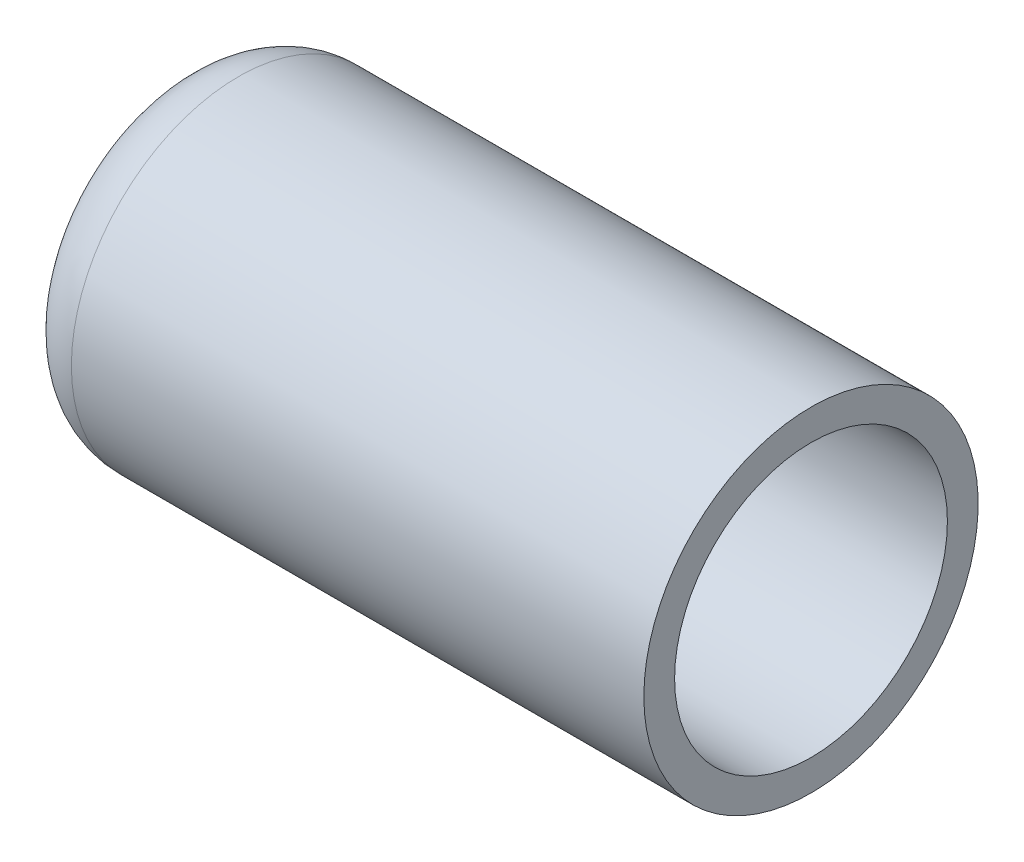
ISO-10303-21;
HEADER;
FILE_DESCRIPTION(('STEP AP214'),'2;1');
FILE_NAME('part.step','',(''),(''),'','','');
FILE_SCHEMA(('AUTOMOTIVE_DESIGN { 1 0 10303 214 1 1 1 1 }'));
ENDSEC;
DATA;
#1=APPLICATION_CONTEXT('core data for automotive mechanical design processes');
#2=APPLICATION_PROTOCOL_DEFINITION('international standard','automotive_design',2000,#1);
#3=PRODUCT_CONTEXT('',#1,'mechanical');
#4=PRODUCT('Part','Part','',(#3));
#5=PRODUCT_RELATED_PRODUCT_CATEGORY('part','',(#4));
#6=PRODUCT_DEFINITION_FORMATION('','',#4);
#7=PRODUCT_DEFINITION_CONTEXT('part definition',#1,'design');
#8=PRODUCT_DEFINITION('design','',#6,#7);
#9=PRODUCT_DEFINITION_SHAPE('','',#8);
#10=(LENGTH_UNIT() NAMED_UNIT(*) SI_UNIT(.MILLI.,.METRE.));
#11=(NAMED_UNIT(*) PLANE_ANGLE_UNIT() SI_UNIT($,.RADIAN.));
#12=(NAMED_UNIT(*) SI_UNIT($,.STERADIAN.) SOLID_ANGLE_UNIT());
#13=UNCERTAINTY_MEASURE_WITH_UNIT(LENGTH_MEASURE(1.E-05),#10,'distance_accuracy_value','');
#14=(GEOMETRIC_REPRESENTATION_CONTEXT(3) GLOBAL_UNCERTAINTY_ASSIGNED_CONTEXT((#13)) GLOBAL_UNIT_ASSIGNED_CONTEXT((#10,
#11,#12)) REPRESENTATION_CONTEXT('',''));
#15=CARTESIAN_POINT('',(0.,0.,0.));
#16=DIRECTION('',(0.,0.,1.));
#17=DIRECTION('',(1.,0.,0.));
#18=AXIS2_PLACEMENT_3D('',#15,#16,#17);
#19=CARTESIAN_POINT('',(-23.9999999999998,0.,0.));
#20=DIRECTION('',(0.,0.,1.));
#21=DIRECTION('',(-1.,0.,0.));
#22=AXIS2_PLACEMENT_3D('',#19,#20,#21);
#23=SPHERICAL_SURFACE('',#22,22.7000000000002);
#24=CARTESIAN_POINT('',(-44.9287800442349,0.,0.));
#25=DIRECTION('',(-1.,0.,0.));
#26=DIRECTION('',(0.,0.,1.));
#27=AXIS2_PLACEMENT_3D('',#24,#25,#26);
#28=CIRCLE('',#27,8.79068631336805);
#29=CARTESIAN_POINT('',(-44.9287800442349,0.,8.79068631336805));
#30=VERTEX_POINT('',#29);
#31=EDGE_CURVE('E17',#30,#30,#28,.T.);
#32=ORIENTED_EDGE('',*,*,#31,.F.);
#33=EDGE_LOOP('',(#32));
#34=FACE_BOUND('',#33,.T.);
#35=ADVANCED_FACE('F13',(#34),#23,.F.);
#36=CARTESIAN_POINT('',(-42.808242873804,0.,0.));
#37=DIRECTION('',(-1.,0.,0.));
#38=DIRECTION('',(0.,0.,1.));
#39=AXIS2_PLACEMENT_3D('',#36,#37,#38);
#40=TOROIDAL_SURFACE('',#39,7.9,2.3);
#41=CARTESIAN_POINT('',(-42.808242873804,0.,0.));
#42=DIRECTION('',(-1.,0.,0.));
#43=DIRECTION('',(0.,1.,0.));
#44=AXIS2_PLACEMENT_3D('',#41,#42,#43);
#45=CIRCLE('',#44,10.2);
#46=CARTESIAN_POINT('',(-42.808242873804,10.2,0.));
#47=VERTEX_POINT('',#46);
#48=EDGE_CURVE('E34',#47,#47,#45,.T.);
#49=ORIENTED_EDGE('',*,*,#48,.F.);
#50=EDGE_LOOP('',(#49));
#51=FACE_BOUND('',#50,.T.);
#52=ORIENTED_EDGE('',*,*,#31,.T.);
#53=EDGE_LOOP('',(#52));
#54=FACE_BOUND('',#53,.T.);
#55=ADVANCED_FACE('F44',(#51,#54),#40,.F.);
#56=CARTESIAN_POINT('',(0.,0.,0.));
#57=DIRECTION('',(-1.,0.,0.));
#58=DIRECTION('',(0.,0.,1.));
#59=AXIS2_PLACEMENT_3D('',#56,#57,#58);
#60=CYLINDRICAL_SURFACE('',#59,10.2);
#61=CARTESIAN_POINT('',(0.,0.,0.));
#62=DIRECTION('',(-1.,0.,0.));
#63=DIRECTION('',(0.,0.,1.));
#64=AXIS2_PLACEMENT_3D('',#61,#62,#63);
#65=CIRCLE('',#64,10.2);
#66=CARTESIAN_POINT('',(0.,0.,10.2));
#67=VERTEX_POINT('',#66);
#68=EDGE_CURVE('E32',#67,#67,#65,.T.);
#69=ORIENTED_EDGE('',*,*,#68,.F.);
#70=EDGE_LOOP('',(#69));
#71=FACE_BOUND('',#70,.T.);
#72=ORIENTED_EDGE('',*,*,#48,.T.);
#73=EDGE_LOOP('',(#72));
#74=FACE_BOUND('',#73,.T.);
#75=ADVANCED_FACE('F47',(#71,#74),#60,.F.);
#76=CARTESIAN_POINT('',(0.,12.5,12.6500021083112));
#77=DIRECTION('',(1.,0.,0.));
#78=DIRECTION('',(0.,-1.,0.));
#79=AXIS2_PLACEMENT_3D('',#76,#77,#78);
#80=PLANE('',#79);
#81=ORIENTED_EDGE('',*,*,#68,.T.);
#82=EDGE_LOOP('',(#81));
#83=FACE_BOUND('',#82,.T.);
#84=CARTESIAN_POINT('',(0.,0.,0.));
#85=DIRECTION('',(-1.,0.,0.));
#86=DIRECTION('',(0.,0.,1.));
#87=AXIS2_PLACEMENT_3D('',#84,#85,#86);
#88=CIRCLE('',#87,12.5);
#89=CARTESIAN_POINT('',(0.,0.,12.5));
#90=VERTEX_POINT('',#89);
#91=EDGE_CURVE('E26',#90,#90,#88,.T.);
#92=ORIENTED_EDGE('',*,*,#91,.F.);
#93=EDGE_LOOP('',(#92));
#94=FACE_BOUND('',#93,.T.);
#95=ADVANCED_FACE('F51',(#83,#94),#80,.T.);
#96=CARTESIAN_POINT('',(-42.808242873804,0.,0.));
#97=DIRECTION('',(-1.,0.,0.));
#98=DIRECTION('',(0.,0.,1.));
#99=AXIS2_PLACEMENT_3D('',#96,#97,#98);
#100=CYLINDRICAL_SURFACE('',#99,12.5);
#101=ORIENTED_EDGE('',*,*,#91,.T.);
#102=EDGE_LOOP('',(#101));
#103=FACE_BOUND('',#102,.T.);
#104=CARTESIAN_POINT('',(-42.808242873804,0.,0.));
#105=DIRECTION('',(-1.,0.,0.));
#106=DIRECTION('',(0.,0.,1.));
#107=AXIS2_PLACEMENT_3D('',#104,#105,#106);
#108=CIRCLE('',#107,12.5);
#109=CARTESIAN_POINT('',(-42.808242873804,0.,12.5));
#110=VERTEX_POINT('',#109);
#111=EDGE_CURVE('E21',#110,#110,#108,.T.);
#112=ORIENTED_EDGE('',*,*,#111,.F.);
#113=EDGE_LOOP('',(#112));
#114=FACE_BOUND('',#113,.T.);
#115=ADVANCED_FACE('F55',(#103,#114),#100,.T.);
#116=CARTESIAN_POINT('',(-42.808242873804,0.,0.));
#117=DIRECTION('',(-1.,0.,0.));
#118=DIRECTION('',(0.,0.,1.));
#119=AXIS2_PLACEMENT_3D('',#116,#117,#118);
#120=TOROIDAL_SURFACE('',#119,7.89999999999998,4.60000000000001);
#121=ORIENTED_EDGE('',*,*,#111,.T.);
#122=EDGE_LOOP('',(#121));
#123=FACE_BOUND('',#122,.T.);
#124=CARTESIAN_POINT('',(-47.0493172473089,0.,0.));
#125=DIRECTION('',(-1.,0.,0.));
#126=DIRECTION('',(0.,0.,1.));
#127=AXIS2_PLACEMENT_3D('',#124,#125,#126);
#128=CIRCLE('',#127,9.6813725490196);
#129=CARTESIAN_POINT('',(-47.0493172473089,0.,9.6813725490196));
#130=VERTEX_POINT('',#129);
#131=EDGE_CURVE('E8',#130,#130,#128,.T.);
#132=ORIENTED_EDGE('',*,*,#131,.F.);
#133=EDGE_LOOP('',(#132));
#134=FACE_BOUND('',#133,.T.);
#135=ADVANCED_FACE('F58',(#123,#134),#120,.T.);
#136=CARTESIAN_POINT('',(-23.9999999999999,0.,0.));
#137=DIRECTION('',(0.,0.,1.));
#138=DIRECTION('',(1.,0.,0.));
#139=AXIS2_PLACEMENT_3D('',#136,#137,#138);
#140=SPHERICAL_SURFACE('',#139,25.0000000000001);
#141=ORIENTED_EDGE('',*,*,#131,.T.);
#142=EDGE_LOOP('',(#141));
#143=FACE_BOUND('',#142,.T.);
#144=ADVANCED_FACE('F62',(#143),#140,.T.);
#145=CLOSED_SHELL('',(#35,#55,#75,#95,#115,#135,#144));
#146=MANIFOLD_SOLID_BREP('B1',#145);
#147=ADVANCED_BREP_SHAPE_REPRESENTATION('',(#18,#146),#14);
#148=SHAPE_DEFINITION_REPRESENTATION(#9,#147);
ENDSEC;
END-ISO-10303-21;
